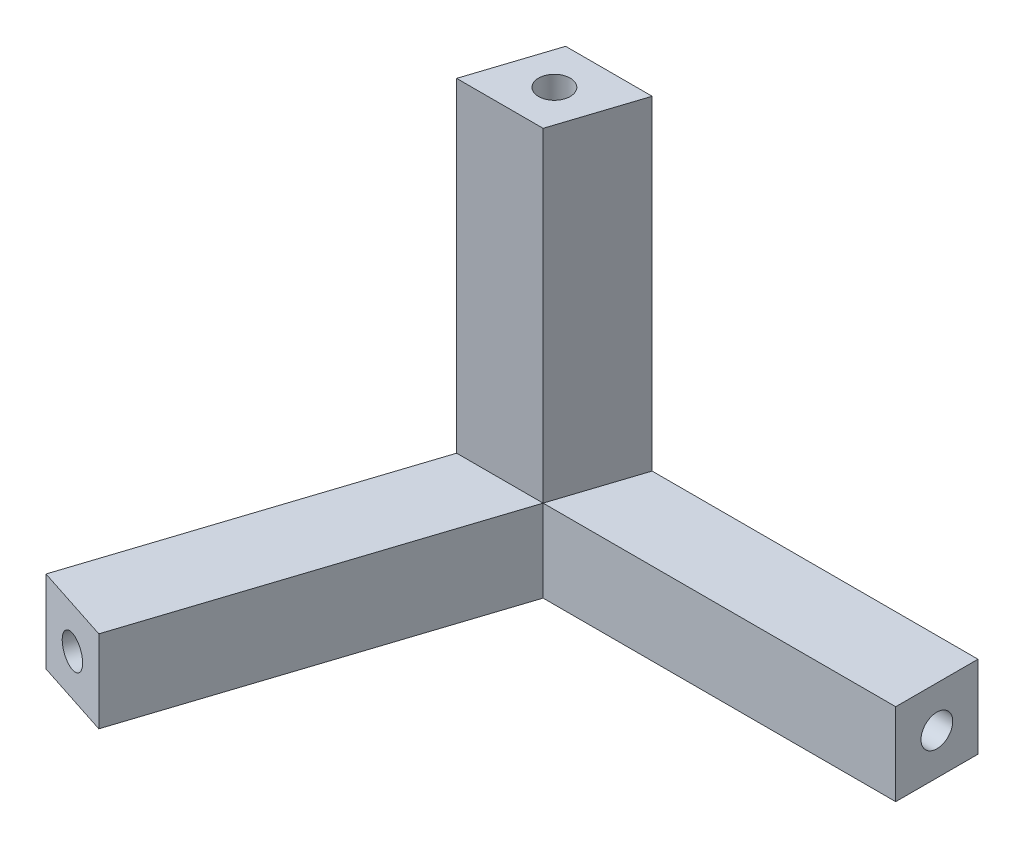
ISO-10303-21;
HEADER;
FILE_DESCRIPTION(('STEP AP214'),'2;1');
FILE_NAME('part.step','',(''),(''),'','','');
FILE_SCHEMA(('AUTOMOTIVE_DESIGN { 1 0 10303 214 1 1 1 1 }'));
ENDSEC;
DATA;
#1=APPLICATION_CONTEXT('core data for automotive mechanical design processes');
#2=APPLICATION_PROTOCOL_DEFINITION('international standard','automotive_design',2000,#1);
#3=PRODUCT_CONTEXT('',#1,'mechanical');
#4=PRODUCT('Part','Part','',(#3));
#5=PRODUCT_RELATED_PRODUCT_CATEGORY('part','',(#4));
#6=PRODUCT_DEFINITION_FORMATION('','',#4);
#7=PRODUCT_DEFINITION_CONTEXT('part definition',#1,'design');
#8=PRODUCT_DEFINITION('design','',#6,#7);
#9=PRODUCT_DEFINITION_SHAPE('','',#8);
#10=(LENGTH_UNIT() NAMED_UNIT(*) SI_UNIT(.MILLI.,.METRE.));
#11=(NAMED_UNIT(*) PLANE_ANGLE_UNIT() SI_UNIT($,.RADIAN.));
#12=(NAMED_UNIT(*) SI_UNIT($,.STERADIAN.) SOLID_ANGLE_UNIT());
#13=UNCERTAINTY_MEASURE_WITH_UNIT(LENGTH_MEASURE(1.E-05),#10,'distance_accuracy_value','');
#14=(GEOMETRIC_REPRESENTATION_CONTEXT(3) GLOBAL_UNCERTAINTY_ASSIGNED_CONTEXT((#13)) GLOBAL_UNIT_ASSIGNED_CONTEXT((#10,
#11,#12)) REPRESENTATION_CONTEXT('',''));
#15=CARTESIAN_POINT('',(0.,0.,0.));
#16=DIRECTION('',(0.,0.,1.));
#17=DIRECTION('',(1.,0.,0.));
#18=AXIS2_PLACEMENT_3D('',#15,#16,#17);
#19=CARTESIAN_POINT('',(0.,1.75,0.));
#20=DIRECTION('',(0.,-1.,0.));
#21=DIRECTION('',(0.,0.,-1.));
#22=AXIS2_PLACEMENT_3D('',#19,#20,#21);
#23=PLANE('',#22);
#24=DIRECTION('',(0.309016994374945,0.,-0.951056516295154));
#25=VECTOR('',#24,1.);
#26=CARTESIAN_POINT('',(1.27144942400939,1.75,1.75));
#27=LINE('',#26,#25);
#28=CARTESIAN_POINT('',(1.27144942400939,1.75,1.75));
#29=VERTEX_POINT('',#28);
#30=CARTESIAN_POINT('',(2.40866836082455,1.75,-1.75));
#31=VERTEX_POINT('',#30);
#32=EDGE_CURVE('E150',#29,#31,#27,.T.);
#33=ORIENTED_EDGE('',*,*,#32,.F.);
#34=DIRECTION('',(1.,0.,0.));
#35=VECTOR('',#34,1.);
#36=CARTESIAN_POINT('',(16.2714494240094,1.75,1.75));
#37=LINE('',#36,#35);
#38=CARTESIAN_POINT('',(16.2714494240094,1.75,1.75));
#39=VERTEX_POINT('',#38);
#40=EDGE_CURVE('E120',#29,#39,#37,.T.);
#41=ORIENTED_EDGE('',*,*,#40,.T.);
#42=DIRECTION('',(0.,0.,-1.));
#43=VECTOR('',#42,1.);
#44=CARTESIAN_POINT('',(16.2714494240094,1.75,-1.75));
#45=LINE('',#44,#43);
#46=CARTESIAN_POINT('',(16.2714494240094,1.75,-1.75));
#47=VERTEX_POINT('',#46);
#48=EDGE_CURVE('E131',#39,#47,#45,.T.);
#49=ORIENTED_EDGE('',*,*,#48,.T.);
#50=DIRECTION('',(-1.,0.,0.));
#51=VECTOR('',#50,1.);
#52=CARTESIAN_POINT('',(-1.27144942400938,1.75,-1.75));
#53=LINE('',#52,#51);
#54=EDGE_CURVE('E151',#47,#31,#53,.T.);
#55=ORIENTED_EDGE('',*,*,#54,.T.);
#56=EDGE_LOOP('',(#33,#41,#49,#55));
#57=FACE_BOUND('',#56,.T.);
#58=ADVANCED_FACE('F45',(#57),#23,.F.);
#59=DIRECTION('',(1.,0.,0.));
#60=VECTOR('',#59,1.);
#61=CARTESIAN_POINT('',(1.27144942400939,1.75,1.75));
#62=LINE('',#61,#60);
#63=CARTESIAN_POINT('',(-2.40866836082455,1.75,1.75));
#64=VERTEX_POINT('',#63);
#65=EDGE_CURVE('E61',#64,#29,#62,.T.);
#66=ORIENTED_EDGE('',*,*,#65,.F.);
#67=DIRECTION('',(-0.309016994374945,0.,0.951056516295154));
#68=VECTOR('',#67,1.);
#69=CARTESIAN_POINT('',(-1.27144942400938,1.75,-1.75));
#70=LINE('',#69,#68);
#71=CARTESIAN_POINT('',(-6.69250329864782,1.75,14.934288264115));
#72=VERTEX_POINT('',#71);
#73=EDGE_CURVE('E215',#64,#72,#70,.T.);
#74=ORIENTED_EDGE('',*,*,#73,.T.);
#75=DIRECTION('',(0.951056516295154,0.,0.309016994374947));
#76=VECTOR('',#75,1.);
#77=CARTESIAN_POINT('',(-3.36380549161478,1.75,16.0158477444273));
#78=LINE('',#77,#76);
#79=CARTESIAN_POINT('',(-3.36380549161478,1.75,16.0158477444273));
#80=VERTEX_POINT('',#79);
#81=EDGE_CURVE('E145',#72,#80,#78,.T.);
#82=ORIENTED_EDGE('',*,*,#81,.T.);
#83=DIRECTION('',(0.309016994374945,0.,-0.951056516295155));
#84=VECTOR('',#83,1.);
#85=CARTESIAN_POINT('',(1.27144942400939,1.75,1.75));
#86=LINE('',#85,#84);
#87=EDGE_CURVE('E132',#80,#29,#86,.T.);
#88=ORIENTED_EDGE('',*,*,#87,.T.);
#89=EDGE_LOOP('',(#66,#74,#82,#88));
#90=FACE_BOUND('',#89,.T.);
#91=ADVANCED_FACE('F143',(#90),#23,.F.);
#92=CARTESIAN_POINT('',(-1.27144942400938,1.75,-1.75));
#93=DIRECTION('',(0.,0.,1.));
#94=DIRECTION('',(1.,0.,0.));
#95=AXIS2_PLACEMENT_3D('',#92,#93,#94);
#96=PLANE('',#95);
#97=DIRECTION('',(-1.,0.,0.));
#98=VECTOR('',#97,1.);
#99=CARTESIAN_POINT('',(-1.27144942400938,-1.75,-1.75));
#100=LINE('',#99,#98);
#101=CARTESIAN_POINT('',(16.2714494240094,-1.75,-1.75));
#102=VERTEX_POINT('',#101);
#103=CARTESIAN_POINT('',(-1.27144942400938,-1.75,-1.75));
#104=VERTEX_POINT('',#103);
#105=EDGE_CURVE('E209',#102,#104,#100,.T.);
#106=ORIENTED_EDGE('',*,*,#105,.T.);
#107=DIRECTION('',(0.,-1.,0.));
#108=VECTOR('',#107,1.);
#109=CARTESIAN_POINT('',(-1.27144942400938,1.75,-1.75));
#110=LINE('',#109,#108);
#111=CARTESIAN_POINT('',(-1.27144942400938,1.75,-1.75));
#112=VERTEX_POINT('',#111);
#113=EDGE_CURVE('E12',#112,#104,#110,.T.);
#114=ORIENTED_EDGE('',*,*,#113,.F.);
#115=DIRECTION('',(-1.,0.,0.));
#116=VECTOR('',#115,1.);
#117=CARTESIAN_POINT('',(2.40866836082455,1.75,-1.75));
#118=LINE('',#117,#116);
#119=EDGE_CURVE('E69',#31,#112,#118,.T.);
#120=ORIENTED_EDGE('',*,*,#119,.F.);
#121=ORIENTED_EDGE('',*,*,#54,.F.);
#122=DIRECTION('',(0.,-1.,0.));
#123=VECTOR('',#122,1.);
#124=CARTESIAN_POINT('',(16.2714494240094,1.75,-1.75));
#125=LINE('',#124,#123);
#126=EDGE_CURVE('E225',#47,#102,#125,.T.);
#127=ORIENTED_EDGE('',*,*,#126,.T.);
#128=EDGE_LOOP('',(#106,#114,#120,#121,#127));
#129=FACE_BOUND('',#128,.T.);
#130=ADVANCED_FACE('F47',(#129),#96,.F.);
#131=CARTESIAN_POINT('',(-1.27144942400938,1.75,-1.75));
#132=DIRECTION('',(0.951056516295154,0.,0.309016994374945));
#133=DIRECTION('',(0.309016994374945,0.,-0.951056516295155));
#134=AXIS2_PLACEMENT_3D('',#131,#132,#133);
#135=PLANE('',#134);
#136=DIRECTION('',(-0.309016994374945,0.,0.951056516295154));
#137=VECTOR('',#136,1.);
#138=CARTESIAN_POINT('',(-1.27144942400938,-1.75,-1.75));
#139=LINE('',#138,#137);
#140=CARTESIAN_POINT('',(-6.69250329864782,-1.75,14.934288264115));
#141=VERTEX_POINT('',#140);
#142=EDGE_CURVE('E229',#104,#141,#139,.T.);
#143=ORIENTED_EDGE('',*,*,#142,.T.);
#144=DIRECTION('',(0.,-1.,0.));
#145=VECTOR('',#144,1.);
#146=CARTESIAN_POINT('',(-6.69250329864782,1.75,14.934288264115));
#147=LINE('',#146,#145);
#148=EDGE_CURVE('E54',#72,#141,#147,.T.);
#149=ORIENTED_EDGE('',*,*,#148,.F.);
#150=ORIENTED_EDGE('',*,*,#73,.F.);
#151=EDGE_CURVE('E217',#112,#64,#70,.T.);
#152=ORIENTED_EDGE('',*,*,#151,.F.);
#153=ORIENTED_EDGE('',*,*,#113,.T.);
#154=EDGE_LOOP('',(#143,#149,#150,#152,#153));
#155=FACE_BOUND('',#154,.T.);
#156=ADVANCED_FACE('F263',(#155),#135,.F.);
#157=CARTESIAN_POINT('',(-3.36380549161478,1.75,16.0158477444273));
#158=DIRECTION('',(0.309016994374947,0.,-0.951056516295154));
#159=DIRECTION('',(-0.951056516295154,0.,-0.309016994374947));
#160=AXIS2_PLACEMENT_3D('',#157,#158,#159);
#161=PLANE('',#160);
#162=CARTESIAN_POINT('',(-5.02815439513134,0.,15.4750680042711));
#163=DIRECTION('',(-0.309016994374947,0.,0.951056516295154));
#164=DIRECTION('',(0.951056516295154,0.,0.309016994374947));
#165=AXIS2_PLACEMENT_3D('',#162,#163,#164);
#166=CIRCLE('',#165,0.675000000000001);
#167=CARTESIAN_POINT('',(-4.38619124663211,0.,15.6836544754742));
#168=VERTEX_POINT('',#167);
#169=EDGE_CURVE('E201',#168,#168,#166,.T.);
#170=ORIENTED_EDGE('',*,*,#169,.F.);
#171=EDGE_LOOP('',(#170));
#172=FACE_BOUND('',#171,.T.);
#173=DIRECTION('',(0.951056516295154,0.,0.309016994374947));
#174=VECTOR('',#173,1.);
#175=CARTESIAN_POINT('',(-3.36380549161478,-1.75,16.0158477444273));
#176=LINE('',#175,#174);
#177=CARTESIAN_POINT('',(-3.36380549161478,-1.75,16.0158477444273));
#178=VERTEX_POINT('',#177);
#179=EDGE_CURVE('E232',#141,#178,#176,.T.);
#180=ORIENTED_EDGE('',*,*,#179,.T.);
#181=DIRECTION('',(0.,-1.,0.));
#182=VECTOR('',#181,1.);
#183=CARTESIAN_POINT('',(-3.36380549161478,1.75,16.0158477444273));
#184=LINE('',#183,#182);
#185=EDGE_CURVE('E141',#80,#178,#184,.T.);
#186=ORIENTED_EDGE('',*,*,#185,.F.);
#187=ORIENTED_EDGE('',*,*,#81,.F.);
#188=ORIENTED_EDGE('',*,*,#148,.T.);
#189=EDGE_LOOP('',(#180,#186,#187,#188));
#190=FACE_BOUND('',#189,.T.);
#191=ADVANCED_FACE('F253',(#172,#190),#161,.F.);
#192=CARTESIAN_POINT('',(1.27144942400939,1.75,1.75));
#193=DIRECTION('',(-0.951056516295155,0.,-0.309016994374945));
#194=DIRECTION('',(-0.309016994374945,0.,0.951056516295155));
#195=AXIS2_PLACEMENT_3D('',#192,#193,#194);
#196=PLANE('',#195);
#197=DIRECTION('',(0.309016994374945,0.,-0.951056516295155));
#198=VECTOR('',#197,1.);
#199=CARTESIAN_POINT('',(1.27144942400939,-1.75,1.75));
#200=LINE('',#199,#198);
#201=CARTESIAN_POINT('',(1.27144942400939,-1.75,1.75));
#202=VERTEX_POINT('',#201);
#203=EDGE_CURVE('E139',#178,#202,#200,.T.);
#204=ORIENTED_EDGE('',*,*,#203,.T.);
#205=DIRECTION('',(0.,-1.,0.));
#206=VECTOR('',#205,1.);
#207=CARTESIAN_POINT('',(1.27144942400939,1.75,1.75));
#208=LINE('',#207,#206);
#209=EDGE_CURVE('E123',#29,#202,#208,.T.);
#210=ORIENTED_EDGE('',*,*,#209,.F.);
#211=ORIENTED_EDGE('',*,*,#87,.F.);
#212=ORIENTED_EDGE('',*,*,#185,.T.);
#213=EDGE_LOOP('',(#204,#210,#211,#212));
#214=FACE_BOUND('',#213,.T.);
#215=ADVANCED_FACE('F136',(#214),#196,.F.);
#216=CARTESIAN_POINT('',(16.2714494240094,1.75,1.75));
#217=DIRECTION('',(0.,0.,-1.));
#218=DIRECTION('',(-1.,0.,0.));
#219=AXIS2_PLACEMENT_3D('',#216,#217,#218);
#220=PLANE('',#219);
#221=DIRECTION('',(1.,0.,0.));
#222=VECTOR('',#221,1.);
#223=CARTESIAN_POINT('',(16.2714494240094,-1.75,1.75));
#224=LINE('',#223,#222);
#225=CARTESIAN_POINT('',(16.2714494240094,-1.75,1.75));
#226=VERTEX_POINT('',#225);
#227=EDGE_CURVE('E237',#202,#226,#224,.T.);
#228=ORIENTED_EDGE('',*,*,#227,.T.);
#229=DIRECTION('',(0.,-1.,0.));
#230=VECTOR('',#229,1.);
#231=CARTESIAN_POINT('',(16.2714494240094,1.75,1.75));
#232=LINE('',#231,#230);
#233=EDGE_CURVE('E126',#39,#226,#232,.T.);
#234=ORIENTED_EDGE('',*,*,#233,.F.);
#235=ORIENTED_EDGE('',*,*,#40,.F.);
#236=ORIENTED_EDGE('',*,*,#209,.T.);
#237=EDGE_LOOP('',(#228,#234,#235,#236));
#238=FACE_BOUND('',#237,.T.);
#239=ADVANCED_FACE('F122',(#238),#220,.F.);
#240=CARTESIAN_POINT('',(16.2714494240094,1.75,-1.75));
#241=DIRECTION('',(-1.,0.,0.));
#242=DIRECTION('',(0.,0.,1.));
#243=AXIS2_PLACEMENT_3D('',#240,#241,#242);
#244=PLANE('',#243);
#245=CARTESIAN_POINT('',(16.2714494240094,0.,0.));
#246=DIRECTION('',(1.,0.,0.));
#247=DIRECTION('',(0.,0.,-1.));
#248=AXIS2_PLACEMENT_3D('',#245,#246,#247);
#249=CIRCLE('',#248,0.674999999999985);
#250=CARTESIAN_POINT('',(16.2714494240094,0.,-0.675000000000001));
#251=VERTEX_POINT('',#250);
#252=EDGE_CURVE('E196',#251,#251,#249,.T.);
#253=ORIENTED_EDGE('',*,*,#252,.F.);
#254=EDGE_LOOP('',(#253));
#255=FACE_BOUND('',#254,.T.);
#256=DIRECTION('',(0.,0.,-1.));
#257=VECTOR('',#256,1.);
#258=CARTESIAN_POINT('',(16.2714494240094,-1.75,-1.75));
#259=LINE('',#258,#257);
#260=EDGE_CURVE('E216',#226,#102,#259,.T.);
#261=ORIENTED_EDGE('',*,*,#260,.T.);
#262=ORIENTED_EDGE('',*,*,#126,.F.);
#263=ORIENTED_EDGE('',*,*,#48,.F.);
#264=ORIENTED_EDGE('',*,*,#233,.T.);
#265=EDGE_LOOP('',(#261,#262,#263,#264));
#266=FACE_BOUND('',#265,.T.);
#267=ADVANCED_FACE('F260',(#255,#266),#244,.F.);
#268=CARTESIAN_POINT('',(0.,-1.75,0.));
#269=DIRECTION('',(0.,-1.,0.));
#270=DIRECTION('',(0.,0.,-1.));
#271=AXIS2_PLACEMENT_3D('',#268,#269,#270);
#272=PLANE('',#271);
#273=ORIENTED_EDGE('',*,*,#105,.F.);
#274=ORIENTED_EDGE('',*,*,#260,.F.);
#275=ORIENTED_EDGE('',*,*,#227,.F.);
#276=ORIENTED_EDGE('',*,*,#203,.F.);
#277=ORIENTED_EDGE('',*,*,#179,.F.);
#278=ORIENTED_EDGE('',*,*,#142,.F.);
#279=EDGE_LOOP('',(#273,#274,#275,#276,#277,#278));
#280=FACE_BOUND('',#279,.T.);
#281=ADVANCED_FACE('F257',(#280),#272,.T.);
#282=CARTESIAN_POINT('',(-0.392899479507137,0.,1.20922025984384));
#283=DIRECTION('',(-0.309016994374947,0.,0.951056516295154));
#284=DIRECTION('',(0.951056516295154,0.,0.309016994374947));
#285=AXIS2_PLACEMENT_3D('',#282,#283,#284);
#286=CYLINDRICAL_SURFACE('',#285,0.675000000000001);
#287=CARTESIAN_POINT('',(-0.392899479507137,0.,1.20922025984384));
#288=DIRECTION('',(-0.309016994374947,0.,0.951056516295154));
#289=DIRECTION('',(0.951056516295154,0.,0.309016994374947));
#290=AXIS2_PLACEMENT_3D('',#287,#288,#289);
#291=CIRCLE('',#290,0.675000000000001);
#292=CARTESIAN_POINT('',(0.249063668992093,0.,1.41780673104693));
#293=VERTEX_POINT('',#292);
#294=EDGE_CURVE('E205',#293,#293,#291,.T.);
#295=ORIENTED_EDGE('',*,*,#294,.F.);
#296=EDGE_LOOP('',(#295));
#297=FACE_BOUND('',#296,.T.);
#298=ORIENTED_EDGE('',*,*,#169,.T.);
#299=EDGE_LOOP('',(#298));
#300=FACE_BOUND('',#299,.T.);
#301=ADVANCED_FACE('F274',(#297,#300),#286,.F.);
#302=CARTESIAN_POINT('',(-0.392899479507137,0.,1.20922025984384));
#303=DIRECTION('',(-0.309016994374947,0.,0.951056516295154));
#304=DIRECTION('',(0.951056516295154,0.,0.309016994374947));
#305=AXIS2_PLACEMENT_3D('',#302,#303,#304);
#306=PLANE('',#305);
#307=ORIENTED_EDGE('',*,*,#294,.T.);
#308=EDGE_LOOP('',(#307));
#309=FACE_BOUND('',#308,.T.);
#310=ADVANCED_FACE('F292',(#309),#306,.T.);
#311=CARTESIAN_POINT('',(1.27144942400938,0.,0.));
#312=DIRECTION('',(1.,0.,0.));
#313=DIRECTION('',(0.,0.,-1.));
#314=AXIS2_PLACEMENT_3D('',#311,#312,#313);
#315=CYLINDRICAL_SURFACE('',#314,0.674999999999985);
#316=CARTESIAN_POINT('',(1.27144942400938,0.,0.));
#317=DIRECTION('',(1.,0.,0.));
#318=DIRECTION('',(0.,0.,-1.));
#319=AXIS2_PLACEMENT_3D('',#316,#317,#318);
#320=CIRCLE('',#319,0.674999999999985);
#321=CARTESIAN_POINT('',(1.27144942400938,0.,-0.674999999999986));
#322=VERTEX_POINT('',#321);
#323=EDGE_CURVE('E197',#322,#322,#320,.T.);
#324=ORIENTED_EDGE('',*,*,#323,.F.);
#325=EDGE_LOOP('',(#324));
#326=FACE_BOUND('',#325,.T.);
#327=ORIENTED_EDGE('',*,*,#252,.T.);
#328=EDGE_LOOP('',(#327));
#329=FACE_BOUND('',#328,.T.);
#330=ADVANCED_FACE('F297',(#326,#329),#315,.F.);
#331=CARTESIAN_POINT('',(1.27144942400938,0.,0.));
#332=DIRECTION('',(1.,0.,0.));
#333=DIRECTION('',(0.,0.,-1.));
#334=AXIS2_PLACEMENT_3D('',#331,#332,#333);
#335=PLANE('',#334);
#336=ORIENTED_EDGE('',*,*,#323,.T.);
#337=EDGE_LOOP('',(#336));
#338=FACE_BOUND('',#337,.T.);
#339=ADVANCED_FACE('F303',(#338),#335,.T.);
#340=CARTESIAN_POINT('',(1.10869177805347,16.6678284305241,1.10869177805347));
#341=DIRECTION('',(0.,1.,0.));
#342=DIRECTION('',(0.,0.,1.));
#343=AXIS2_PLACEMENT_3D('',#340,#341,#342);
#344=PLANE('',#343);
#345=CARTESIAN_POINT('',(1.10869177805347,16.6678284305241,1.10869177805347));
#346=DIRECTION('',(0.,1.,0.));
#347=DIRECTION('',(0.707106781186548,0.,0.707106781186547));
#348=AXIS2_PLACEMENT_3D('',#345,#346,#347);
#349=ELLIPSE('',#348,0.678718088705373,0.675);
#350=CARTESIAN_POINT('',(1.58861794109101,16.6678284305241,1.58861794109101));
#351=VERTEX_POINT('',#350);
#352=EDGE_CURVE('E157',#351,#351,#349,.F.);
#353=ORIENTED_EDGE('',*,*,#352,.T.);
#354=EDGE_LOOP('',(#353));
#355=FACE_BOUND('',#354,.T.);
#356=DIRECTION('',(0.309016994374945,0.,-0.951056516295154));
#357=VECTOR('',#356,1.);
#358=CARTESIAN_POINT('',(2.38014120206285,16.6678284305241,2.85869177805347));
#359=LINE('',#358,#357);
#360=CARTESIAN_POINT('',(2.38014120206285,16.6678284305241,2.85869177805347));
#361=VERTEX_POINT('',#360);
#362=CARTESIAN_POINT('',(3.51736013887801,16.6678284305241,-0.641308221946534));
#363=VERTEX_POINT('',#362);
#364=EDGE_CURVE('E171',#361,#363,#359,.T.);
#365=ORIENTED_EDGE('',*,*,#364,.T.);
#366=DIRECTION('',(-1.,0.,0.));
#367=VECTOR('',#366,1.);
#368=CARTESIAN_POINT('',(3.51736013887802,16.6678284305241,-0.641308221946534));
#369=LINE('',#368,#367);
#370=CARTESIAN_POINT('',(-0.162757645955917,16.6678284305241,-0.641308221946525));
#371=VERTEX_POINT('',#370);
#372=EDGE_CURVE('E181',#363,#371,#369,.T.);
#373=ORIENTED_EDGE('',*,*,#372,.T.);
#374=DIRECTION('',(-0.309016994374945,0.,0.951056516295154));
#375=VECTOR('',#374,1.);
#376=CARTESIAN_POINT('',(-1.29997658277108,16.6678284305241,2.85869177805347));
#377=LINE('',#376,#375);
#378=CARTESIAN_POINT('',(-1.29997658277108,16.6678284305241,2.85869177805347));
#379=VERTEX_POINT('',#378);
#380=EDGE_CURVE('E188',#371,#379,#377,.T.);
#381=ORIENTED_EDGE('',*,*,#380,.T.);
#382=DIRECTION('',(1.,0.,0.));
#383=VECTOR('',#382,1.);
#384=CARTESIAN_POINT('',(2.38014120206285,16.6678284305241,2.85869177805347));
#385=LINE('',#384,#383);
#386=EDGE_CURVE('E192',#379,#361,#385,.T.);
#387=ORIENTED_EDGE('',*,*,#386,.T.);
#388=EDGE_LOOP('',(#365,#373,#381,#387));
#389=FACE_BOUND('',#388,.T.);
#390=ADVANCED_FACE('F309',(#355,#389),#344,.T.);
#391=CARTESIAN_POINT('',(1.27144942400939,1.75,1.75));
#392=DIRECTION('',(0.946913340499268,-0.0932405894283625,0.307670794953906));
#393=DIRECTION('',(0.309016994374945,0.,-0.951056516295154));
#394=AXIS2_PLACEMENT_3D('',#391,#392,#393);
#395=PLANE('',#394);
#396=DIRECTION('',(0.0739127852035645,0.994521895368274,0.0739127852035645));
#397=VECTOR('',#396,1.);
#398=CARTESIAN_POINT('',(2.40866836082455,1.75,-1.75));
#399=LINE('',#398,#397);
#400=EDGE_CURVE('E175',#31,#363,#399,.T.);
#401=ORIENTED_EDGE('',*,*,#400,.T.);
#402=ORIENTED_EDGE('',*,*,#364,.F.);
#403=DIRECTION('',(0.0739127852035645,0.994521895368274,0.0739127852035645));
#404=VECTOR('',#403,1.);
#405=CARTESIAN_POINT('',(1.27144942400939,1.75,1.75));
#406=LINE('',#405,#404);
#407=EDGE_CURVE('E164',#29,#361,#406,.T.);
#408=ORIENTED_EDGE('',*,*,#407,.F.);
#409=ORIENTED_EDGE('',*,*,#32,.T.);
#410=EDGE_LOOP('',(#401,#402,#408,#409));
#411=FACE_BOUND('',#410,.T.);
#412=ADVANCED_FACE('F170',(#411),#395,.T.);
#413=CARTESIAN_POINT('',(2.40866836082455,1.75,-1.75));
#414=DIRECTION('',(0.,0.0741155126847491,-0.997249663213519));
#415=DIRECTION('',(0.,0.997249663213519,0.0741155126847491));
#416=AXIS2_PLACEMENT_3D('',#413,#414,#415);
#417=PLANE('',#416);
#418=DIRECTION('',(0.0739127852035645,0.994521895368274,0.0739127852035645));
#419=VECTOR('',#418,1.);
#420=CARTESIAN_POINT('',(-1.27144942400938,1.75,-1.74999999999999));
#421=LINE('',#420,#419);
#422=EDGE_CURVE('E184',#112,#371,#421,.T.);
#423=ORIENTED_EDGE('',*,*,#422,.T.);
#424=ORIENTED_EDGE('',*,*,#372,.F.);
#425=ORIENTED_EDGE('',*,*,#400,.F.);
#426=ORIENTED_EDGE('',*,*,#119,.T.);
#427=EDGE_LOOP('',(#423,#424,#425,#426));
#428=FACE_BOUND('',#427,.T.);
#429=ADVANCED_FACE('F320',(#428),#417,.T.);
#430=CARTESIAN_POINT('',(-2.40866836082455,1.75,1.75));
#431=DIRECTION('',(-0.946913340499268,0.0932405894283626,-0.307670794953907));
#432=DIRECTION('',(-0.309016994374945,0.,0.951056516295154));
#433=AXIS2_PLACEMENT_3D('',#430,#431,#432);
#434=PLANE('',#433);
#435=DIRECTION('',(0.0739127852035645,0.994521895368274,0.0739127852035645));
#436=VECTOR('',#435,1.);
#437=CARTESIAN_POINT('',(-2.40866836082455,1.75,1.75));
#438=LINE('',#437,#436);
#439=EDGE_CURVE('E166',#64,#379,#438,.T.);
#440=ORIENTED_EDGE('',*,*,#439,.T.);
#441=ORIENTED_EDGE('',*,*,#380,.F.);
#442=ORIENTED_EDGE('',*,*,#422,.F.);
#443=ORIENTED_EDGE('',*,*,#151,.T.);
#444=EDGE_LOOP('',(#440,#441,#442,#443));
#445=FACE_BOUND('',#444,.T.);
#446=ADVANCED_FACE('F317',(#445),#434,.T.);
#447=CARTESIAN_POINT('',(1.27144942400939,1.75,1.75));
#448=DIRECTION('',(0.,-0.0741155126847489,0.997249663213519));
#449=DIRECTION('',(0.,-0.997249663213519,-0.0741155126847489));
#450=AXIS2_PLACEMENT_3D('',#447,#448,#449);
#451=PLANE('',#450);
#452=ORIENTED_EDGE('',*,*,#386,.F.);
#453=ORIENTED_EDGE('',*,*,#439,.F.);
#454=ORIENTED_EDGE('',*,*,#65,.T.);
#455=ORIENTED_EDGE('',*,*,#407,.T.);
#456=EDGE_LOOP('',(#452,#453,#454,#455));
#457=FACE_BOUND('',#456,.T.);
#458=ADVANCED_FACE('F163',(#457),#451,.T.);
#459=CARTESIAN_POINT('',(0.,1.75,0.));
#460=DIRECTION('',(0.0739127852035645,0.994521895368274,0.0739127852035645));
#461=DIRECTION('',(-0.997249663213519,0.074115512684749,0.));
#462=AXIS2_PLACEMENT_3D('',#459,#460,#461);
#463=PLANE('',#462);
#464=CARTESIAN_POINT('',(0.,1.75,0.));
#465=DIRECTION('',(0.0739127852035645,0.994521895368274,0.0739127852035645));
#466=DIRECTION('',(-0.997249663213519,0.074115512684749,0.));
#467=AXIS2_PLACEMENT_3D('',#464,#465,#466);
#468=CIRCLE('',#467,0.675);
#469=CARTESIAN_POINT('',(-0.673143522669126,1.80002797106221,0.));
#470=VERTEX_POINT('',#469);
#471=EDGE_CURVE('E337',#470,#470,#468,.T.);
#472=ORIENTED_EDGE('',*,*,#471,.T.);
#473=EDGE_LOOP('',(#472));
#474=FACE_BOUND('',#473,.T.);
#475=ADVANCED_FACE('F314',(#474),#463,.T.);
#476=CARTESIAN_POINT('',(0.,1.75,0.));
#477=DIRECTION('',(0.0739127852035645,0.994521895368274,0.0739127852035645));
#478=DIRECTION('',(-0.997249663213519,0.0741155126847489,0.));
#479=AXIS2_PLACEMENT_3D('',#476,#477,#478);
#480=CYLINDRICAL_SURFACE('',#479,0.675);
#481=ORIENTED_EDGE('',*,*,#471,.F.);
#482=EDGE_LOOP('',(#481));
#483=FACE_BOUND('',#482,.T.);
#484=ORIENTED_EDGE('',*,*,#352,.F.);
#485=EDGE_LOOP('',(#484));
#486=FACE_BOUND('',#485,.T.);
#487=ADVANCED_FACE('F327',(#483,#486),#480,.F.);
#488=CLOSED_SHELL('',(#58,#91,#130,#156,#191,#215,#239,#267,#281,#301,#310,#330,#339,#390,#412,
#429,#446,#458,#475,#487));
#489=MANIFOLD_SOLID_BREP('B2',#488);
#490=ADVANCED_BREP_SHAPE_REPRESENTATION('',(#18,#489),#14);
#491=SHAPE_DEFINITION_REPRESENTATION(#9,#490);
ENDSEC;
END-ISO-10303-21;
